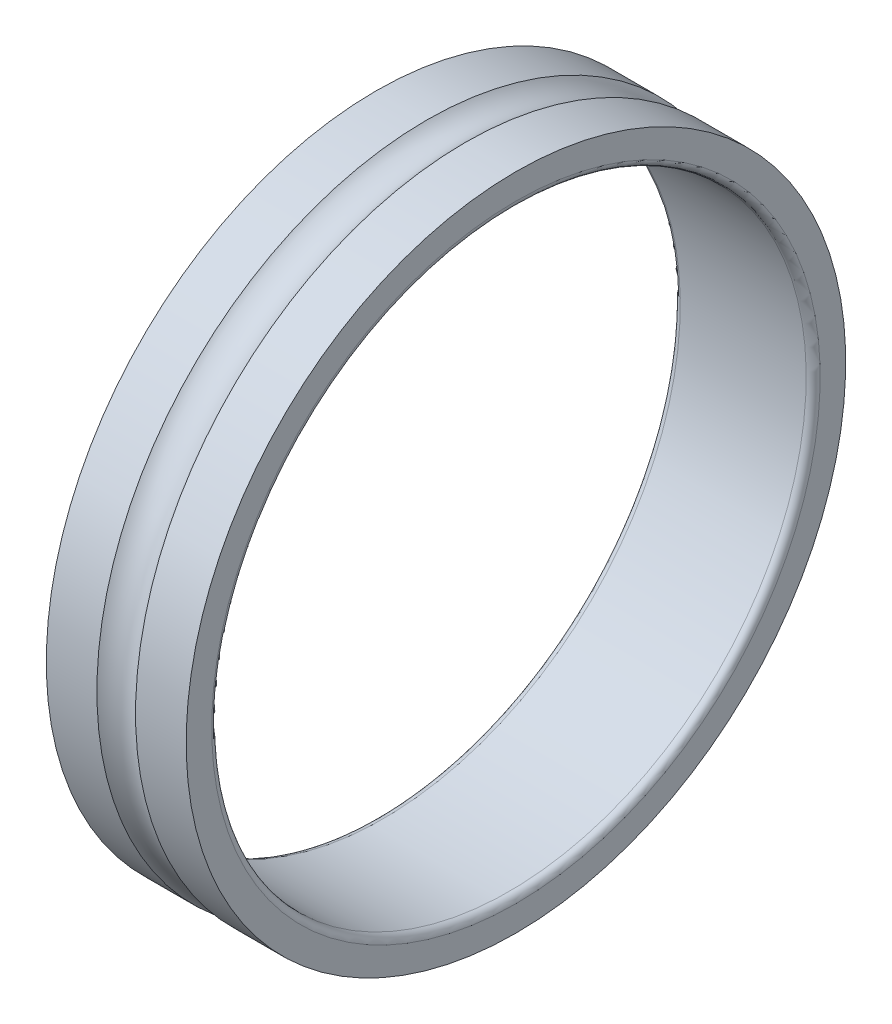
ISO-10303-21;
HEADER;
FILE_DESCRIPTION(('STEP AP214'),'2;1');
FILE_NAME('part.step','',(''),(''),'','','');
FILE_SCHEMA(('AUTOMOTIVE_DESIGN { 1 0 10303 214 1 1 1 1 }'));
ENDSEC;
DATA;
#1=APPLICATION_CONTEXT('core data for automotive mechanical design processes');
#2=APPLICATION_PROTOCOL_DEFINITION('international standard','automotive_design',2000,#1);
#3=PRODUCT_CONTEXT('',#1,'mechanical');
#4=PRODUCT('Part','Part','',(#3));
#5=PRODUCT_RELATED_PRODUCT_CATEGORY('part','',(#4));
#6=PRODUCT_DEFINITION_FORMATION('','',#4);
#7=PRODUCT_DEFINITION_CONTEXT('part definition',#1,'design');
#8=PRODUCT_DEFINITION('design','',#6,#7);
#9=PRODUCT_DEFINITION_SHAPE('','',#8);
#10=(LENGTH_UNIT() NAMED_UNIT(*) SI_UNIT(.MILLI.,.METRE.));
#11=(NAMED_UNIT(*) PLANE_ANGLE_UNIT() SI_UNIT($,.RADIAN.));
#12=(NAMED_UNIT(*) SI_UNIT($,.STERADIAN.) SOLID_ANGLE_UNIT());
#13=UNCERTAINTY_MEASURE_WITH_UNIT(LENGTH_MEASURE(1.E-05),#10,'distance_accuracy_value','');
#14=(GEOMETRIC_REPRESENTATION_CONTEXT(3) GLOBAL_UNCERTAINTY_ASSIGNED_CONTEXT((#13)) GLOBAL_UNIT_ASSIGNED_CONTEXT((#10,
#11,#12)) REPRESENTATION_CONTEXT('',''));
#15=CARTESIAN_POINT('',(0.,0.,0.));
#16=DIRECTION('',(0.,0.,1.));
#17=DIRECTION('',(1.,0.,0.));
#18=AXIS2_PLACEMENT_3D('',#15,#16,#17);
#19=CARTESIAN_POINT('',(3.27637655472199,0.,0.));
#20=DIRECTION('',(-1.,0.,0.));
#21=DIRECTION('',(0.,1.,0.));
#22=AXIS2_PLACEMENT_3D('',#19,#20,#21);
#23=CYLINDRICAL_SURFACE('',#22,9.43);
#24=CARTESIAN_POINT('',(2.55275310944399,0.,0.));
#25=DIRECTION('',(1.,0.,0.));
#26=DIRECTION('',(0.,1.,0.));
#27=AXIS2_PLACEMENT_3D('',#24,#25,#26);
#28=CIRCLE('',#27,9.43);
#29=CARTESIAN_POINT('',(2.55275310944399,9.43,0.));
#30=VERTEX_POINT('',#29);
#31=EDGE_CURVE('E11',#30,#30,#28,.T.);
#32=ORIENTED_EDGE('',*,*,#31,.T.);
#33=EDGE_LOOP('',(#32));
#34=FACE_BOUND('',#33,.T.);
#35=CARTESIAN_POINT('',(4.,0.,0.));
#36=DIRECTION('',(1.,0.,0.));
#37=DIRECTION('',(0.,1.,0.));
#38=AXIS2_PLACEMENT_3D('',#35,#36,#37);
#39=CIRCLE('',#38,9.43);
#40=CARTESIAN_POINT('',(4.,9.43,0.));
#41=VERTEX_POINT('',#40);
#42=EDGE_CURVE('E55',#41,#41,#39,.T.);
#43=ORIENTED_EDGE('',*,*,#42,.F.);
#44=EDGE_LOOP('',(#43));
#45=FACE_BOUND('',#44,.T.);
#46=ADVANCED_FACE('F16',(#34,#45),#23,.T.);
#47=CARTESIAN_POINT('',(2.,0.,0.));
#48=DIRECTION('',(1.,0.,0.));
#49=DIRECTION('',(0.,0.,-1.));
#50=AXIS2_PLACEMENT_3D('',#47,#48,#49);
#51=TOROIDAL_SURFACE('',#50,10.,0.794);
#52=CARTESIAN_POINT('',(1.44724689055601,0.,0.));
#53=DIRECTION('',(1.,0.,0.));
#54=DIRECTION('',(0.,1.,0.));
#55=AXIS2_PLACEMENT_3D('',#52,#53,#54);
#56=CIRCLE('',#55,9.43);
#57=CARTESIAN_POINT('',(1.44724689055601,9.43,0.));
#58=VERTEX_POINT('',#57);
#59=EDGE_CURVE('E20',#58,#58,#56,.T.);
#60=ORIENTED_EDGE('',*,*,#59,.T.);
#61=EDGE_LOOP('',(#60));
#62=FACE_BOUND('',#61,.T.);
#63=ORIENTED_EDGE('',*,*,#31,.F.);
#64=EDGE_LOOP('',(#63));
#65=FACE_BOUND('',#64,.T.);
#66=ADVANCED_FACE('F78',(#62,#65),#51,.F.);
#67=CARTESIAN_POINT('',(0.723623445278005,0.,0.));
#68=DIRECTION('',(-1.,0.,0.));
#69=DIRECTION('',(0.,1.,0.));
#70=AXIS2_PLACEMENT_3D('',#67,#68,#69);
#71=CYLINDRICAL_SURFACE('',#70,9.43);
#72=CARTESIAN_POINT('',(0.,0.,0.));
#73=DIRECTION('',(1.,0.,0.));
#74=DIRECTION('',(0.,1.,0.));
#75=AXIS2_PLACEMENT_3D('',#72,#73,#74);
#76=CIRCLE('',#75,9.43);
#77=CARTESIAN_POINT('',(0.,9.43,0.));
#78=VERTEX_POINT('',#77);
#79=EDGE_CURVE('E63',#78,#78,#76,.T.);
#80=ORIENTED_EDGE('',*,*,#79,.T.);
#81=EDGE_LOOP('',(#80));
#82=FACE_BOUND('',#81,.T.);
#83=ORIENTED_EDGE('',*,*,#59,.F.);
#84=EDGE_LOOP('',(#83));
#85=FACE_BOUND('',#84,.T.);
#86=ADVANCED_FACE('F83',(#82,#85),#71,.T.);
#87=CARTESIAN_POINT('',(0.,9.065,0.));
#88=DIRECTION('',(-1.,0.,0.));
#89=DIRECTION('',(0.,-1.,0.));
#90=AXIS2_PLACEMENT_3D('',#87,#88,#89);
#91=PLANE('',#90);
#92=CARTESIAN_POINT('',(0.,0.,0.));
#93=DIRECTION('',(1.,0.,0.));
#94=DIRECTION('',(0.,1.,0.));
#95=AXIS2_PLACEMENT_3D('',#92,#93,#94);
#96=CIRCLE('',#95,8.7);
#97=CARTESIAN_POINT('',(0.,8.7,0.));
#98=VERTEX_POINT('',#97);
#99=EDGE_CURVE('E57',#98,#98,#96,.T.);
#100=ORIENTED_EDGE('',*,*,#99,.T.);
#101=EDGE_LOOP('',(#100));
#102=FACE_BOUND('',#101,.T.);
#103=ORIENTED_EDGE('',*,*,#79,.F.);
#104=EDGE_LOOP('',(#103));
#105=FACE_BOUND('',#104,.T.);
#106=ADVANCED_FACE('F91',(#102,#105),#91,.T.);
#107=CARTESIAN_POINT('',(0.2,0.,0.));
#108=DIRECTION('',(1.,0.,0.));
#109=DIRECTION('',(0.,0.,-1.));
#110=AXIS2_PLACEMENT_3D('',#107,#108,#109);
#111=TOROIDAL_SURFACE('',#110,8.7,0.2);
#112=CARTESIAN_POINT('',(0.2,0.,0.));
#113=DIRECTION('',(1.,0.,0.));
#114=DIRECTION('',(0.,1.,0.));
#115=AXIS2_PLACEMENT_3D('',#112,#113,#114);
#116=CIRCLE('',#115,8.5);
#117=CARTESIAN_POINT('',(0.2,8.5,0.));
#118=VERTEX_POINT('',#117);
#119=EDGE_CURVE('E46',#118,#118,#116,.T.);
#120=ORIENTED_EDGE('',*,*,#119,.T.);
#121=EDGE_LOOP('',(#120));
#122=FACE_BOUND('',#121,.T.);
#123=ORIENTED_EDGE('',*,*,#99,.F.);
#124=EDGE_LOOP('',(#123));
#125=FACE_BOUND('',#124,.T.);
#126=ADVANCED_FACE('F93',(#122,#125),#111,.T.);
#127=CARTESIAN_POINT('',(2.,0.,0.));
#128=DIRECTION('',(-1.,0.,0.));
#129=DIRECTION('',(0.,1.,0.));
#130=AXIS2_PLACEMENT_3D('',#127,#128,#129);
#131=CYLINDRICAL_SURFACE('',#130,8.5);
#132=CARTESIAN_POINT('',(3.8,0.,0.));
#133=DIRECTION('',(1.,0.,0.));
#134=DIRECTION('',(0.,1.,0.));
#135=AXIS2_PLACEMENT_3D('',#132,#133,#134);
#136=CIRCLE('',#135,8.5);
#137=CARTESIAN_POINT('',(3.8,8.5,0.));
#138=VERTEX_POINT('',#137);
#139=EDGE_CURVE('E51',#138,#138,#136,.T.);
#140=ORIENTED_EDGE('',*,*,#139,.T.);
#141=EDGE_LOOP('',(#140));
#142=FACE_BOUND('',#141,.T.);
#143=ORIENTED_EDGE('',*,*,#119,.F.);
#144=EDGE_LOOP('',(#143));
#145=FACE_BOUND('',#144,.T.);
#146=ADVANCED_FACE('F52',(#142,#145),#131,.F.);
#147=CARTESIAN_POINT('',(3.8,0.,0.));
#148=DIRECTION('',(1.,0.,0.));
#149=DIRECTION('',(0.,0.,-1.));
#150=AXIS2_PLACEMENT_3D('',#147,#148,#149);
#151=TOROIDAL_SURFACE('',#150,8.7,0.2);
#152=CARTESIAN_POINT('',(4.,0.,0.));
#153=DIRECTION('',(1.,0.,0.));
#154=DIRECTION('',(0.,1.,0.));
#155=AXIS2_PLACEMENT_3D('',#152,#153,#154);
#156=CIRCLE('',#155,8.7);
#157=CARTESIAN_POINT('',(4.,8.7,0.));
#158=VERTEX_POINT('',#157);
#159=EDGE_CURVE('E59',#158,#158,#156,.T.);
#160=ORIENTED_EDGE('',*,*,#159,.T.);
#161=EDGE_LOOP('',(#160));
#162=FACE_BOUND('',#161,.T.);
#163=ORIENTED_EDGE('',*,*,#139,.F.);
#164=EDGE_LOOP('',(#163));
#165=FACE_BOUND('',#164,.T.);
#166=ADVANCED_FACE('F68',(#162,#165),#151,.T.);
#167=CARTESIAN_POINT('',(4.,9.065,0.));
#168=DIRECTION('',(1.,0.,0.));
#169=DIRECTION('',(0.,1.,0.));
#170=AXIS2_PLACEMENT_3D('',#167,#168,#169);
#171=PLANE('',#170);
#172=ORIENTED_EDGE('',*,*,#42,.T.);
#173=EDGE_LOOP('',(#172));
#174=FACE_BOUND('',#173,.T.);
#175=ORIENTED_EDGE('',*,*,#159,.F.);
#176=EDGE_LOOP('',(#175));
#177=FACE_BOUND('',#176,.T.);
#178=ADVANCED_FACE('F18',(#174,#177),#171,.T.);
#179=CLOSED_SHELL('',(#46,#66,#86,#106,#126,#146,#166,#178));
#180=MANIFOLD_SOLID_BREP('B1',#179);
#181=ADVANCED_BREP_SHAPE_REPRESENTATION('',(#18,#180),#14);
#182=SHAPE_DEFINITION_REPRESENTATION(#9,#181);
ENDSEC;
END-ISO-10303-21;
